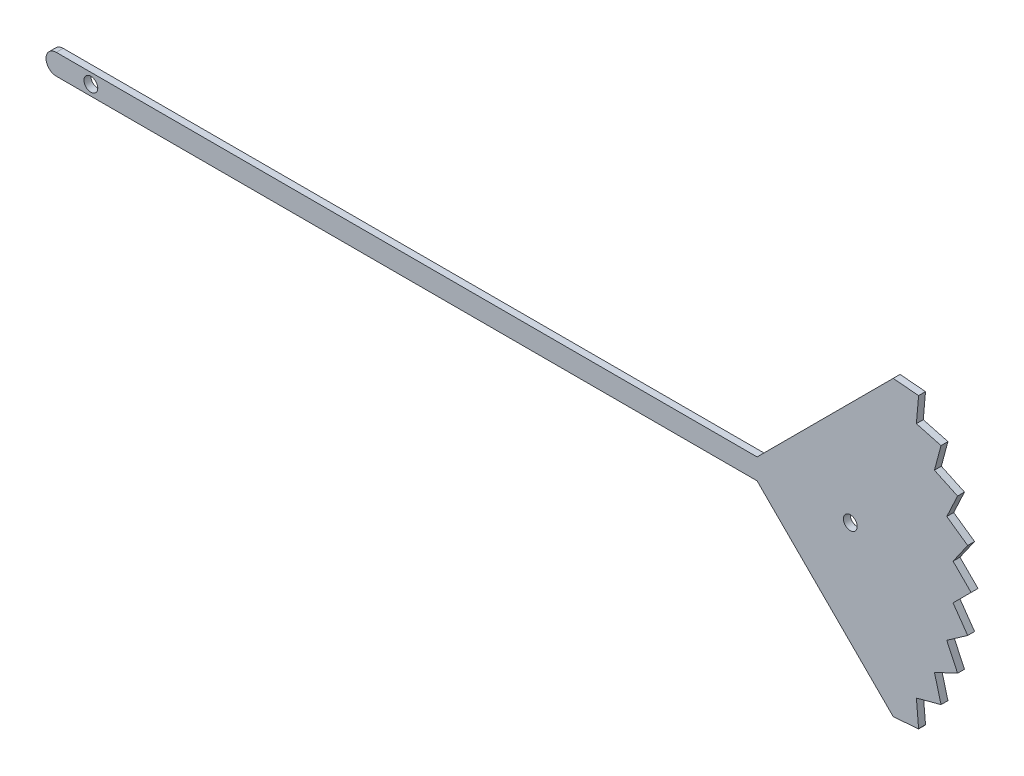
ISO-10303-21;
HEADER;
FILE_DESCRIPTION(('STEP AP214'),'2;1');
FILE_NAME('part.step','',(''),(''),'','','');
FILE_SCHEMA(('AUTOMOTIVE_DESIGN { 1 0 10303 214 1 1 1 1 }'));
ENDSEC;
DATA;
#1=APPLICATION_CONTEXT('core data for automotive mechanical design processes');
#2=APPLICATION_PROTOCOL_DEFINITION('international standard','automotive_design',2000,#1);
#3=PRODUCT_CONTEXT('',#1,'mechanical');
#4=PRODUCT('Part','Part','',(#3));
#5=PRODUCT_RELATED_PRODUCT_CATEGORY('part','',(#4));
#6=PRODUCT_DEFINITION_FORMATION('','',#4);
#7=PRODUCT_DEFINITION_CONTEXT('part definition',#1,'design');
#8=PRODUCT_DEFINITION('design','',#6,#7);
#9=PRODUCT_DEFINITION_SHAPE('','',#8);
#10=(LENGTH_UNIT() NAMED_UNIT(*) SI_UNIT(.MILLI.,.METRE.));
#11=(NAMED_UNIT(*) PLANE_ANGLE_UNIT() SI_UNIT($,.RADIAN.));
#12=(NAMED_UNIT(*) SI_UNIT($,.STERADIAN.) SOLID_ANGLE_UNIT());
#13=UNCERTAINTY_MEASURE_WITH_UNIT(LENGTH_MEASURE(1.E-05),#10,'distance_accuracy_value','');
#14=(GEOMETRIC_REPRESENTATION_CONTEXT(3) GLOBAL_UNCERTAINTY_ASSIGNED_CONTEXT((#13)) GLOBAL_UNIT_ASSIGNED_CONTEXT((#10,
#11,#12)) REPRESENTATION_CONTEXT('',''));
#15=CARTESIAN_POINT('',(0.,0.,0.));
#16=DIRECTION('',(0.,0.,1.));
#17=DIRECTION('',(1.,0.,0.));
#18=AXIS2_PLACEMENT_3D('',#15,#16,#17);
#19=CARTESIAN_POINT('',(67.9759144826428,3.,1.));
#20=DIRECTION('',(0.,1.,0.));
#21=DIRECTION('',(0.,0.,1.));
#22=AXIS2_PLACEMENT_3D('',#19,#20,#21);
#23=PLANE('',#22);
#24=DIRECTION('',(1.,0.,0.));
#25=VECTOR('',#24,1.);
#26=CARTESIAN_POINT('',(67.9759144826428,3.,-1.));
#27=LINE('',#26,#25);
#28=CARTESIAN_POINT('',(-62.7323713453704,3.,-1.));
#29=VERTEX_POINT('',#28);
#30=CARTESIAN_POINT('',(140.287932097177,3.,-1.));
#31=VERTEX_POINT('',#30);
#32=EDGE_CURVE('E230',#29,#31,#27,.T.);
#33=ORIENTED_EDGE('',*,*,#32,.F.);
#34=DIRECTION('',(0.,0.,-1.));
#35=VECTOR('',#34,1.);
#36=CARTESIAN_POINT('',(-62.7323713453704,3.,1.));
#37=LINE('',#36,#35);
#38=CARTESIAN_POINT('',(-62.7323713453704,3.,1.));
#39=VERTEX_POINT('',#38);
#40=EDGE_CURVE('E11',#39,#29,#37,.T.);
#41=ORIENTED_EDGE('',*,*,#40,.F.);
#42=DIRECTION('',(1.,0.,0.));
#43=VECTOR('',#42,1.);
#44=CARTESIAN_POINT('',(67.9759144826428,3.,1.));
#45=LINE('',#44,#43);
#46=CARTESIAN_POINT('',(140.287932097177,3.,1.));
#47=VERTEX_POINT('',#46);
#48=EDGE_CURVE('E708',#39,#47,#45,.T.);
#49=ORIENTED_EDGE('',*,*,#48,.T.);
#50=DIRECTION('',(0.,0.,-1.));
#51=VECTOR('',#50,1.);
#52=CARTESIAN_POINT('',(140.287932097177,3.,1.));
#53=LINE('',#52,#51);
#54=EDGE_CURVE('E50',#47,#31,#53,.T.);
#55=ORIENTED_EDGE('',*,*,#54,.T.);
#56=EDGE_LOOP('',(#33,#41,#49,#55));
#57=FACE_BOUND('',#56,.T.);
#58=ADVANCED_FACE('F33',(#57),#23,.T.);
#59=CARTESIAN_POINT('',(-62.7120679028232,0.,1.));
#60=DIRECTION('',(0.,0.,-1.));
#61=DIRECTION('',(-1.,0.,0.));
#62=AXIS2_PLACEMENT_3D('',#59,#60,#61);
#63=CYLINDRICAL_SURFACE('',#62,3.0000687041765);
#64=CARTESIAN_POINT('',(-62.7120679028232,0.,-1.));
#65=DIRECTION('',(0.,0.,1.));
#66=DIRECTION('',(1.,0.,0.));
#67=AXIS2_PLACEMENT_3D('',#64,#65,#66);
#68=CIRCLE('',#67,3.0000687041765);
#69=CARTESIAN_POINT('',(-62.7323713453704,-3.,-1.));
#70=VERTEX_POINT('',#69);
#71=EDGE_CURVE('E232',#29,#70,#68,.T.);
#72=ORIENTED_EDGE('',*,*,#71,.T.);
#73=DIRECTION('',(0.,0.,-1.));
#74=VECTOR('',#73,1.);
#75=CARTESIAN_POINT('',(-62.7323713453704,-3.,1.));
#76=LINE('',#75,#74);
#77=CARTESIAN_POINT('',(-62.7323713453704,-3.,1.));
#78=VERTEX_POINT('',#77);
#79=EDGE_CURVE('E42',#78,#70,#76,.T.);
#80=ORIENTED_EDGE('',*,*,#79,.F.);
#81=CARTESIAN_POINT('',(-62.7120679028232,0.,1.));
#82=DIRECTION('',(0.,0.,1.));
#83=DIRECTION('',(1.,0.,0.));
#84=AXIS2_PLACEMENT_3D('',#81,#82,#83);
#85=CIRCLE('',#84,3.0000687041765);
#86=EDGE_CURVE('E706',#39,#78,#85,.T.);
#87=ORIENTED_EDGE('',*,*,#86,.F.);
#88=ORIENTED_EDGE('',*,*,#40,.T.);
#89=EDGE_LOOP('',(#72,#80,#87,#88));
#90=FACE_BOUND('',#89,.T.);
#91=ADVANCED_FACE('F348',(#90),#63,.T.);
#92=CARTESIAN_POINT('',(67.9759144826428,-3.,1.));
#93=DIRECTION('',(0.,1.,0.));
#94=DIRECTION('',(0.,0.,1.));
#95=AXIS2_PLACEMENT_3D('',#92,#93,#94);
#96=PLANE('',#95);
#97=DIRECTION('',(1.,0.,0.));
#98=VECTOR('',#97,1.);
#99=CARTESIAN_POINT('',(67.9759144826428,-3.,-1.));
#100=LINE('',#99,#98);
#101=CARTESIAN_POINT('',(140.287932097177,-3.,-1.));
#102=VERTEX_POINT('',#101);
#103=EDGE_CURVE('E235',#70,#102,#100,.T.);
#104=ORIENTED_EDGE('',*,*,#103,.T.);
#105=DIRECTION('',(0.,0.,-1.));
#106=VECTOR('',#105,1.);
#107=CARTESIAN_POINT('',(140.287932097177,-3.,1.));
#108=LINE('',#107,#106);
#109=CARTESIAN_POINT('',(140.287932097177,-3.,1.));
#110=VERTEX_POINT('',#109);
#111=EDGE_CURVE('E336',#110,#102,#108,.T.);
#112=ORIENTED_EDGE('',*,*,#111,.F.);
#113=DIRECTION('',(1.,0.,0.));
#114=VECTOR('',#113,1.);
#115=CARTESIAN_POINT('',(67.9759144826428,-3.,1.));
#116=LINE('',#115,#114);
#117=EDGE_CURVE('E344',#78,#110,#116,.T.);
#118=ORIENTED_EDGE('',*,*,#117,.F.);
#119=ORIENTED_EDGE('',*,*,#79,.T.);
#120=EDGE_LOOP('',(#104,#112,#118,#119));
#121=FACE_BOUND('',#120,.T.);
#122=ADVANCED_FACE('F341',(#121),#96,.F.);
#123=CARTESIAN_POINT('',(205.577231788848,-68.2892996916711,1.));
#124=DIRECTION('',(0.707106781186547,0.707106781186547,0.));
#125=DIRECTION('',(-0.707106781186548,0.707106781186548,0.));
#126=AXIS2_PLACEMENT_3D('',#123,#124,#125);
#127=PLANE('',#126);
#128=DIRECTION('',(0.707106781186548,-0.707106781186548,0.));
#129=VECTOR('',#128,1.);
#130=CARTESIAN_POINT('',(205.577231788848,-68.2892996916711,-1.));
#131=LINE('',#130,#129);
#132=CARTESIAN_POINT('',(179.71433896837,-42.4264068711929,-1.));
#133=VERTEX_POINT('',#132);
#134=EDGE_CURVE('E238',#102,#133,#131,.T.);
#135=ORIENTED_EDGE('',*,*,#134,.T.);
#136=DIRECTION('',(0.,0.,-1.));
#137=VECTOR('',#136,1.);
#138=CARTESIAN_POINT('',(179.71433896837,-42.4264068711929,1.));
#139=LINE('',#138,#137);
#140=CARTESIAN_POINT('',(179.71433896837,-42.4264068711929,1.));
#141=VERTEX_POINT('',#140);
#142=EDGE_CURVE('E334',#141,#133,#139,.T.);
#143=ORIENTED_EDGE('',*,*,#142,.F.);
#144=DIRECTION('',(0.707106781186548,-0.707106781186548,0.));
#145=VECTOR('',#144,1.);
#146=CARTESIAN_POINT('',(205.577231788848,-68.2892996916711,1.));
#147=LINE('',#146,#145);
#148=EDGE_CURVE('E630',#110,#141,#147,.T.);
#149=ORIENTED_EDGE('',*,*,#148,.F.);
#150=ORIENTED_EDGE('',*,*,#111,.T.);
#151=EDGE_LOOP('',(#135,#143,#149,#150));
#152=FACE_BOUND('',#151,.T.);
#153=ADVANCED_FACE('F454',(#152),#127,.F.);
#154=CARTESIAN_POINT('',(56.5048975861414,-51.5857938224155,1.));
#155=DIRECTION('',(0.0741354063934308,-0.997248184515209,0.));
#156=DIRECTION('',(0.997248184515209,0.0741354063934308,0.));
#157=AXIS2_PLACEMENT_3D('',#154,#155,#156);
#158=PLANE('',#157);
#159=DIRECTION('',(-0.997248184515209,-0.0741354063934308,0.));
#160=VECTOR('',#159,1.);
#161=CARTESIAN_POINT('',(56.5048975861414,-51.5857938224155,-1.));
#162=LINE('',#161,#160);
#163=CARTESIAN_POINT('',(187.058698636574,-41.8804273475835,-1.));
#164=VERTEX_POINT('',#163);
#165=EDGE_CURVE('E241',#164,#133,#162,.T.);
#166=ORIENTED_EDGE('',*,*,#165,.F.);
#167=DIRECTION('',(0.,0.,-1.));
#168=VECTOR('',#167,1.);
#169=CARTESIAN_POINT('',(187.058698636574,-41.8804273475835,1.));
#170=LINE('',#169,#168);
#171=CARTESIAN_POINT('',(187.058698636574,-41.8804273475835,1.));
#172=VERTEX_POINT('',#171);
#173=EDGE_CURVE('E332',#172,#164,#170,.T.);
#174=ORIENTED_EDGE('',*,*,#173,.F.);
#175=DIRECTION('',(-0.997248184515209,-0.0741354063934308,0.));
#176=VECTOR('',#175,1.);
#177=CARTESIAN_POINT('',(56.5048975861414,-51.5857938224155,1.));
#178=LINE('',#177,#176);
#179=EDGE_CURVE('E626',#172,#141,#178,.T.);
#180=ORIENTED_EDGE('',*,*,#179,.T.);
#181=ORIENTED_EDGE('',*,*,#142,.T.);
#182=EDGE_LOOP('',(#166,#174,#180,#181));
#183=FACE_BOUND('',#182,.T.);
#184=ADVANCED_FACE('F450',(#183),#158,.T.);
#185=CARTESIAN_POINT('',(146.588411182905,-223.415949260086,1.));
#186=DIRECTION('',(0.976039892039487,-0.217591656888646,0.));
#187=DIRECTION('',(0.217591656888646,0.976039892039487,0.));
#188=AXIS2_PLACEMENT_3D('',#185,#186,#187);
#189=PLANE('',#188);
#190=DIRECTION('',(-0.217591656888646,-0.976039892039487,0.));
#191=VECTOR('',#190,1.);
#192=CARTESIAN_POINT('',(146.588411182905,-223.415949260086,-1.));
#193=LINE('',#192,#191);
#194=CARTESIAN_POINT('',(187.080820899911,-41.7811946296231,-1.));
#195=VERTEX_POINT('',#194);
#196=EDGE_CURVE('E244',#195,#164,#193,.T.);
#197=ORIENTED_EDGE('',*,*,#196,.F.);
#198=DIRECTION('',(0.,0.,-1.));
#199=VECTOR('',#198,1.);
#200=CARTESIAN_POINT('',(187.080820899911,-41.7811946296231,1.));
#201=LINE('',#200,#199);
#202=CARTESIAN_POINT('',(187.080820899911,-41.7811946296231,1.));
#203=VERTEX_POINT('',#202);
#204=EDGE_CURVE('E330',#203,#195,#201,.T.);
#205=ORIENTED_EDGE('',*,*,#204,.F.);
#206=DIRECTION('',(-0.217591656888646,-0.976039892039487,0.));
#207=VECTOR('',#206,1.);
#208=CARTESIAN_POINT('',(146.588411182905,-223.415949260086,1.));
#209=LINE('',#208,#207);
#210=EDGE_CURVE('E629',#203,#172,#209,.T.);
#211=ORIENTED_EDGE('',*,*,#210,.T.);
#212=ORIENTED_EDGE('',*,*,#173,.T.);
#213=EDGE_LOOP('',(#197,#205,#211,#212));
#214=FACE_BOUND('',#213,.T.);
#215=ADVANCED_FACE('F446',(#214),#189,.T.);
#216=CARTESIAN_POINT('',(200.41090190856,-194.317155212037,1.));
#217=DIRECTION('',(0.996203247885629,0.0870579628875118,0.));
#218=DIRECTION('',(-0.0870579628875118,0.99620324788563,0.));
#219=AXIS2_PLACEMENT_3D('',#216,#217,#218);
#220=PLANE('',#219);
#221=DIRECTION('',(0.0870579628875118,-0.99620324788563,0.));
#222=VECTOR('',#221,1.);
#223=CARTESIAN_POINT('',(200.41090190856,-194.317155212037,-1.));
#224=LINE('',#223,#222);
#225=CARTESIAN_POINT('',(186.437054754515,-34.4145861810592,-1.));
#226=VERTEX_POINT('',#225);
#227=EDGE_CURVE('E247',#226,#195,#224,.T.);
#228=ORIENTED_EDGE('',*,*,#227,.F.);
#229=DIRECTION('',(0.,0.,-1.));
#230=VECTOR('',#229,1.);
#231=CARTESIAN_POINT('',(186.437054754515,-34.4145861810592,1.));
#232=LINE('',#231,#230);
#233=CARTESIAN_POINT('',(186.437054754515,-34.4145861810592,1.));
#234=VERTEX_POINT('',#233);
#235=EDGE_CURVE('E328',#234,#226,#232,.T.);
#236=ORIENTED_EDGE('',*,*,#235,.F.);
#237=DIRECTION('',(0.0870579628875118,-0.99620324788563,0.));
#238=VECTOR('',#237,1.);
#239=CARTESIAN_POINT('',(200.41090190856,-194.317155212037,1.));
#240=LINE('',#239,#238);
#241=EDGE_CURVE('E632',#234,#203,#240,.T.);
#242=ORIENTED_EDGE('',*,*,#241,.T.);
#243=ORIENTED_EDGE('',*,*,#204,.T.);
#244=EDGE_LOOP('',(#228,#236,#242,#243));
#245=FACE_BOUND('',#244,.T.);
#246=ADVANCED_FACE('F442',(#245),#220,.T.);
#247=CARTESIAN_POINT('',(33.0335379981473,-75.5350730874777,1.));
#248=DIRECTION('',(0.258913852317546,-0.96590041778544,0.));
#249=DIRECTION('',(0.96590041778544,0.258913852317546,0.));
#250=AXIS2_PLACEMENT_3D('',#247,#248,#249);
#251=PLANE('',#250);
#252=DIRECTION('',(-0.96590041778544,-0.258913852317546,0.));
#253=VECTOR('',#252,1.);
#254=CARTESIAN_POINT('',(33.0335379981473,-75.5350730874777,-1.));
#255=LINE('',#254,#253);
#256=CARTESIAN_POINT('',(193.579583343163,-32.4999999999961,-1.));
#257=VERTEX_POINT('',#256);
#258=EDGE_CURVE('E250',#257,#226,#255,.T.);
#259=ORIENTED_EDGE('',*,*,#258,.F.);
#260=DIRECTION('',(0.,0.,-1.));
#261=VECTOR('',#260,1.);
#262=CARTESIAN_POINT('',(193.579583343163,-32.4999999999961,1.));
#263=LINE('',#262,#261);
#264=CARTESIAN_POINT('',(193.579583343163,-32.4999999999961,1.));
#265=VERTEX_POINT('',#264);
#266=EDGE_CURVE('E326',#265,#257,#263,.T.);
#267=ORIENTED_EDGE('',*,*,#266,.F.);
#268=DIRECTION('',(-0.96590041778544,-0.258913852317546,0.));
#269=VECTOR('',#268,1.);
#270=CARTESIAN_POINT('',(33.0335379981473,-75.5350730874777,1.));
#271=LINE('',#270,#269);
#272=EDGE_CURVE('E639',#265,#234,#271,.T.);
#273=ORIENTED_EDGE('',*,*,#272,.T.);
#274=ORIENTED_EDGE('',*,*,#235,.T.);
#275=EDGE_LOOP('',(#259,#267,#273,#274));
#276=FACE_BOUND('',#275,.T.);
#277=ADVANCED_FACE('F438',(#276),#251,.T.);
#278=CARTESIAN_POINT('',(228.50481077251,-162.893916071956,1.));
#279=DIRECTION('',(-0.965951225486896,-0.258724235394299,0.));
#280=DIRECTION('',(0.258724235394299,-0.965951225486896,0.));
#281=AXIS2_PLACEMENT_3D('',#278,#279,#280);
#282=PLANE('',#281);
#283=DIRECTION('',(-0.258724235394299,0.965951225486896,0.));
#284=VECTOR('',#283,1.);
#285=CARTESIAN_POINT('',(228.50481077251,-162.893916071956,-1.));
#286=LINE('',#285,#284);
#287=CARTESIAN_POINT('',(191.666399319372,-25.357095704437,-1.));
#288=VERTEX_POINT('',#287);
#289=EDGE_CURVE('E253',#257,#288,#286,.T.);
#290=ORIENTED_EDGE('',*,*,#289,.T.);
#291=DIRECTION('',(0.,0.,-1.));
#292=VECTOR('',#291,1.);
#293=CARTESIAN_POINT('',(191.666399319372,-25.357095704437,1.));
#294=LINE('',#293,#292);
#295=CARTESIAN_POINT('',(191.666399319372,-25.357095704437,1.));
#296=VERTEX_POINT('',#295);
#297=EDGE_CURVE('E324',#296,#288,#294,.T.);
#298=ORIENTED_EDGE('',*,*,#297,.F.);
#299=DIRECTION('',(-0.258724235394299,0.965951225486896,0.));
#300=VECTOR('',#299,1.);
#301=CARTESIAN_POINT('',(228.50481077251,-162.893916071956,1.));
#302=LINE('',#301,#300);
#303=EDGE_CURVE('E642',#265,#296,#302,.T.);
#304=ORIENTED_EDGE('',*,*,#303,.F.);
#305=ORIENTED_EDGE('',*,*,#266,.T.);
#306=EDGE_LOOP('',(#290,#298,#304,#305));
#307=FACE_BOUND('',#306,.T.);
#308=ADVANCED_FACE('F434',(#307),#282,.F.);
#309=CARTESIAN_POINT('',(20.917363160888,-104.999083579561,1.));
#310=DIRECTION('',(0.422707216480779,-0.90626630144515,0.));
#311=DIRECTION('',(0.90626630144515,0.422707216480779,0.));
#312=AXIS2_PLACEMENT_3D('',#309,#310,#311);
#313=PLANE('',#312);
#314=DIRECTION('',(-0.90626630144515,-0.422707216480779,0.));
#315=VECTOR('',#314,1.);
#316=CARTESIAN_POINT('',(20.917363160888,-104.999083579561,-1.));
#317=LINE('',#316,#315);
#318=CARTESIAN_POINT('',(198.367952448256,-22.231309316163,-1.));
#319=VERTEX_POINT('',#318);
#320=EDGE_CURVE('E256',#319,#288,#317,.T.);
#321=ORIENTED_EDGE('',*,*,#320,.F.);
#322=DIRECTION('',(0.,0.,-1.));
#323=VECTOR('',#322,1.);
#324=CARTESIAN_POINT('',(198.367952448256,-22.231309316163,1.));
#325=LINE('',#324,#323);
#326=CARTESIAN_POINT('',(198.367952448256,-22.231309316163,1.));
#327=VERTEX_POINT('',#326);
#328=EDGE_CURVE('E322',#327,#319,#325,.T.);
#329=ORIENTED_EDGE('',*,*,#328,.F.);
#330=DIRECTION('',(-0.90626630144515,-0.422707216480779,0.));
#331=VECTOR('',#330,1.);
#332=CARTESIAN_POINT('',(20.917363160888,-104.999083579561,1.));
#333=LINE('',#332,#331);
#334=EDGE_CURVE('E644',#327,#296,#333,.T.);
#335=ORIENTED_EDGE('',*,*,#334,.T.);
#336=ORIENTED_EDGE('',*,*,#297,.T.);
#337=EDGE_LOOP('',(#321,#329,#335,#336));
#338=FACE_BOUND('',#337,.T.);
#339=ADVANCED_FACE('F430',(#338),#313,.T.);
#340=CARTESIAN_POINT('',(245.422937317849,-123.166914500319,1.));
#341=DIRECTION('',(0.906349263896627,0.422529302929444,0.));
#342=DIRECTION('',(-0.422529302929444,0.906349263896627,0.));
#343=AXIS2_PLACEMENT_3D('',#340,#341,#342);
#344=PLANE('',#343);
#345=DIRECTION('',(0.422529302929444,-0.906349263896627,0.));
#346=VECTOR('',#345,1.);
#347=CARTESIAN_POINT('',(245.422937317849,-123.166914500319,-1.));
#348=LINE('',#347,#346);
#349=CARTESIAN_POINT('',(195.243481674514,-15.5291427061455,-1.));
#350=VERTEX_POINT('',#349);
#351=EDGE_CURVE('E259',#350,#319,#348,.T.);
#352=ORIENTED_EDGE('',*,*,#351,.F.);
#353=DIRECTION('',(0.,0.,-1.));
#354=VECTOR('',#353,1.);
#355=CARTESIAN_POINT('',(195.243481674514,-15.5291427061455,1.));
#356=LINE('',#355,#354);
#357=CARTESIAN_POINT('',(195.243481674514,-15.5291427061455,1.));
#358=VERTEX_POINT('',#357);
#359=EDGE_CURVE('E320',#358,#350,#356,.T.);
#360=ORIENTED_EDGE('',*,*,#359,.F.);
#361=DIRECTION('',(0.422529302929444,-0.906349263896627,0.));
#362=VECTOR('',#361,1.);
#363=CARTESIAN_POINT('',(245.422937317849,-123.166914500319,1.));
#364=LINE('',#363,#362);
#365=EDGE_CURVE('E647',#358,#327,#364,.T.);
#366=ORIENTED_EDGE('',*,*,#365,.T.);
#367=ORIENTED_EDGE('',*,*,#328,.T.);
#368=EDGE_LOOP('',(#352,#360,#366,#367));
#369=FACE_BOUND('',#368,.T.);
#370=ADVANCED_FACE('F426',(#369),#344,.T.);
#371=CARTESIAN_POINT('',(20.4103759551562,-137.974176975834,1.));
#372=DIRECTION('',(-0.573656835771419,0.819095742128308,0.));
#373=DIRECTION('',(-0.819095742128308,-0.573656835771419,0.));
#374=AXIS2_PLACEMENT_3D('',#371,#372,#373);
#375=PLANE('',#374);
#376=DIRECTION('',(0.819095742128308,0.573656835771419,0.));
#377=VECTOR('',#376,1.);
#378=CARTESIAN_POINT('',(20.4103759551562,-137.974176975834,-1.));
#379=LINE('',#378,#377);
#380=CARTESIAN_POINT('',(201.300436042962,-11.287131548344,-1.));
#381=VERTEX_POINT('',#380);
#382=EDGE_CURVE('E262',#350,#381,#379,.T.);
#383=ORIENTED_EDGE('',*,*,#382,.T.);
#384=DIRECTION('',(0.,0.,-1.));
#385=VECTOR('',#384,1.);
#386=CARTESIAN_POINT('',(201.300436042962,-11.287131548344,1.));
#387=LINE('',#386,#385);
#388=CARTESIAN_POINT('',(201.300436042962,-11.287131548344,1.));
#389=VERTEX_POINT('',#388);
#390=EDGE_CURVE('E318',#389,#381,#387,.T.);
#391=ORIENTED_EDGE('',*,*,#390,.F.);
#392=DIRECTION('',(0.819095742128308,0.573656835771419,0.));
#393=VECTOR('',#392,1.);
#394=CARTESIAN_POINT('',(20.4103759551562,-137.974176975834,1.));
#395=LINE('',#394,#393);
#396=EDGE_CURVE('E650',#358,#389,#395,.T.);
#397=ORIENTED_EDGE('',*,*,#396,.F.);
#398=ORIENTED_EDGE('',*,*,#359,.T.);
#399=EDGE_LOOP('',(#383,#391,#397,#398));
#400=FACE_BOUND('',#399,.T.);
#401=ADVANCED_FACE('F422',(#400),#375,.F.);
#402=CARTESIAN_POINT('',(248.877502782056,-79.2484210123428,1.));
#403=DIRECTION('',(0.819208338557716,0.573496031405193,0.));
#404=DIRECTION('',(-0.573496031405193,0.819208338557716,0.));
#405=AXIS2_PLACEMENT_3D('',#402,#403,#404);
#406=PLANE('',#405);
#407=DIRECTION('',(0.573496031405193,-0.819208338557716,0.));
#408=VECTOR('',#407,1.);
#409=CARTESIAN_POINT('',(248.877502782056,-79.2484210123428,-1.));
#410=LINE('',#409,#408);
#411=CARTESIAN_POINT('',(197.059613982671,-5.22934456485358,-1.));
#412=VERTEX_POINT('',#411);
#413=EDGE_CURVE('E265',#412,#381,#410,.T.);
#414=ORIENTED_EDGE('',*,*,#413,.F.);
#415=DIRECTION('',(0.,0.,-1.));
#416=VECTOR('',#415,1.);
#417=CARTESIAN_POINT('',(197.059613982671,-5.22934456485358,1.));
#418=LINE('',#417,#416);
#419=CARTESIAN_POINT('',(197.059613982671,-5.22934456485358,1.));
#420=VERTEX_POINT('',#419);
#421=EDGE_CURVE('E316',#420,#412,#418,.T.);
#422=ORIENTED_EDGE('',*,*,#421,.F.);
#423=DIRECTION('',(0.573496031405193,-0.819208338557716,0.));
#424=VECTOR('',#423,1.);
#425=CARTESIAN_POINT('',(248.877502782056,-79.2484210123428,1.));
#426=LINE('',#425,#424);
#427=EDGE_CURVE('E652',#420,#389,#426,.T.);
#428=ORIENTED_EDGE('',*,*,#427,.T.);
#429=ORIENTED_EDGE('',*,*,#390,.T.);
#430=EDGE_LOOP('',(#414,#422,#428,#429));
#431=FACE_BOUND('',#430,.T.);
#432=ADVANCED_FACE('F418',(#431),#406,.T.);
#433=CARTESIAN_POINT('',(32.1997998939296,-170.121524781622,1.));
#434=DIRECTION('',(0.707176182390224,-0.707037373170605,0.));
#435=DIRECTION('',(0.707037373170605,0.707176182390224,0.));
#436=AXIS2_PLACEMENT_3D('',#433,#434,#435);
#437=PLANE('',#436);
#438=DIRECTION('',(-0.707037373170605,-0.707176182390224,0.));
#439=VECTOR('',#438,1.);
#440=CARTESIAN_POINT('',(32.1997998939296,-170.121524781622,-1.));
#441=LINE('',#440,#439);
#442=CARTESIAN_POINT('',(202.287932097177,0.,-1.));
#443=VERTEX_POINT('',#442);
#444=EDGE_CURVE('E268',#443,#412,#441,.T.);
#445=ORIENTED_EDGE('',*,*,#444,.F.);
#446=DIRECTION('',(0.,0.,-1.));
#447=VECTOR('',#446,1.);
#448=CARTESIAN_POINT('',(202.287932097177,0.,1.));
#449=LINE('',#448,#447);
#450=CARTESIAN_POINT('',(202.287932097177,0.,1.));
#451=VERTEX_POINT('',#450);
#452=EDGE_CURVE('E314',#451,#443,#449,.T.);
#453=ORIENTED_EDGE('',*,*,#452,.F.);
#454=DIRECTION('',(-0.707037373170605,-0.707176182390224,0.));
#455=VECTOR('',#454,1.);
#456=CARTESIAN_POINT('',(32.1997998939296,-170.121524781622,1.));
#457=LINE('',#456,#455);
#458=EDGE_CURVE('E655',#451,#420,#457,.T.);
#459=ORIENTED_EDGE('',*,*,#458,.T.);
#460=ORIENTED_EDGE('',*,*,#421,.T.);
#461=EDGE_LOOP('',(#445,#453,#459,#460));
#462=FACE_BOUND('',#461,.T.);
#463=ADVANCED_FACE('F414',(#462),#437,.T.);
#464=CARTESIAN_POINT('',(238.090412924918,-35.8095097553379,1.));
#465=DIRECTION('',(0.707176182391343,0.707037373169485,0.));
#466=DIRECTION('',(-0.707037373169485,0.707176182391343,0.));
#467=AXIS2_PLACEMENT_3D('',#464,#465,#466);
#468=PLANE('',#467);
#469=DIRECTION('',(0.707037373169485,-0.707176182391343,0.));
#470=VECTOR('',#469,1.);
#471=CARTESIAN_POINT('',(238.090412924918,-35.8095097553379,-1.));
#472=LINE('',#471,#470);
#473=CARTESIAN_POINT('',(197.059613982682,5.22934456485977,-1.));
#474=VERTEX_POINT('',#473);
#475=EDGE_CURVE('E271',#474,#443,#472,.T.);
#476=ORIENTED_EDGE('',*,*,#475,.F.);
#477=DIRECTION('',(0.,0.,-1.));
#478=VECTOR('',#477,1.);
#479=CARTESIAN_POINT('',(197.059613982682,5.22934456485977,1.));
#480=LINE('',#479,#478);
#481=CARTESIAN_POINT('',(197.059613982682,5.22934456485977,1.));
#482=VERTEX_POINT('',#481);
#483=EDGE_CURVE('E312',#482,#474,#480,.T.);
#484=ORIENTED_EDGE('',*,*,#483,.F.);
#485=DIRECTION('',(0.707037373169485,-0.707176182391343,0.));
#486=VECTOR('',#485,1.);
#487=CARTESIAN_POINT('',(238.090412924918,-35.8095097553379,1.));
#488=LINE('',#487,#486);
#489=EDGE_CURVE('E658',#482,#451,#488,.T.);
#490=ORIENTED_EDGE('',*,*,#489,.T.);
#491=ORIENTED_EDGE('',*,*,#452,.T.);
#492=EDGE_LOOP('',(#476,#484,#490,#491));
#493=FACE_BOUND('',#492,.T.);
#494=ADVANCED_FACE('F410',(#493),#468,.T.);
#495=CARTESIAN_POINT('',(55.4174366405834,-197.098913027202,1.));
#496=DIRECTION('',(0.819208338557849,-0.573496031405003,0.));
#497=DIRECTION('',(0.573496031405003,0.819208338557849,0.));
#498=AXIS2_PLACEMENT_3D('',#495,#496,#497);
#499=PLANE('',#498);
#500=DIRECTION('',(-0.573496031405003,-0.819208338557849,0.));
#501=VECTOR('',#500,1.);
#502=CARTESIAN_POINT('',(55.4174366405834,-197.098913027202,-1.));
#503=LINE('',#502,#501);
#504=CARTESIAN_POINT('',(201.300436042971,11.2871315483506,-1.));
#505=VERTEX_POINT('',#504);
#506=EDGE_CURVE('E274',#505,#474,#503,.T.);
#507=ORIENTED_EDGE('',*,*,#506,.F.);
#508=DIRECTION('',(0.,0.,-1.));
#509=VECTOR('',#508,1.);
#510=CARTESIAN_POINT('',(201.300436042971,11.2871315483506,1.));
#511=LINE('',#510,#509);
#512=CARTESIAN_POINT('',(201.300436042971,11.2871315483506,1.));
#513=VERTEX_POINT('',#512);
#514=EDGE_CURVE('E310',#513,#505,#511,.T.);
#515=ORIENTED_EDGE('',*,*,#514,.F.);
#516=DIRECTION('',(-0.573496031405003,-0.819208338557849,0.));
#517=VECTOR('',#516,1.);
#518=CARTESIAN_POINT('',(55.4174366405834,-197.098913027202,1.));
#519=LINE('',#518,#517);
#520=EDGE_CURVE('E661',#513,#482,#519,.T.);
#521=ORIENTED_EDGE('',*,*,#520,.T.);
#522=ORIENTED_EDGE('',*,*,#483,.T.);
#523=EDGE_LOOP('',(#507,#515,#521,#522));
#524=FACE_BOUND('',#523,.T.);
#525=ADVANCED_FACE('F406',(#524),#499,.T.);
#526=CARTESIAN_POINT('',(213.898089321875,2.46431689259224,1.));
#527=DIRECTION('',(0.573656835771253,0.819095742128424,0.));
#528=DIRECTION('',(-0.819095742128424,0.573656835771253,0.));
#529=AXIS2_PLACEMENT_3D('',#526,#527,#528);
#530=PLANE('',#529);
#531=DIRECTION('',(0.819095742128424,-0.573656835771253,0.));
#532=VECTOR('',#531,1.);
#533=CARTESIAN_POINT('',(213.898089321875,2.46431689259224,-1.));
#534=LINE('',#533,#532);
#535=CARTESIAN_POINT('',(195.243481674521,15.5291427061512,-1.));
#536=VERTEX_POINT('',#535);
#537=EDGE_CURVE('E277',#536,#505,#534,.T.);
#538=ORIENTED_EDGE('',*,*,#537,.F.);
#539=DIRECTION('',(0.,0.,-1.));
#540=VECTOR('',#539,1.);
#541=CARTESIAN_POINT('',(195.243481674521,15.5291427061512,1.));
#542=LINE('',#541,#540);
#543=CARTESIAN_POINT('',(195.243481674521,15.5291427061512,1.));
#544=VERTEX_POINT('',#543);
#545=EDGE_CURVE('E308',#544,#536,#542,.T.);
#546=ORIENTED_EDGE('',*,*,#545,.F.);
#547=DIRECTION('',(0.819095742128424,-0.573656835771253,0.));
#548=VECTOR('',#547,1.);
#549=CARTESIAN_POINT('',(213.898089321875,2.46431689259224,1.));
#550=LINE('',#549,#548);
#551=EDGE_CURVE('E664',#544,#513,#550,.T.);
#552=ORIENTED_EDGE('',*,*,#551,.T.);
#553=ORIENTED_EDGE('',*,*,#514,.T.);
#554=EDGE_LOOP('',(#538,#546,#552,#553));
#555=FACE_BOUND('',#554,.T.);
#556=ADVANCED_FACE('F402',(#555),#530,.T.);
#557=CARTESIAN_POINT('',(87.7275572088137,-215.098599135926,1.));
#558=DIRECTION('',(0.906349263896736,-0.422529302929211,0.));
#559=DIRECTION('',(0.422529302929211,0.906349263896736,0.));
#560=AXIS2_PLACEMENT_3D('',#557,#558,#559);
#561=PLANE('',#560);
#562=DIRECTION('',(-0.422529302929211,-0.906349263896736,0.));
#563=VECTOR('',#562,1.);
#564=CARTESIAN_POINT('',(87.7275572088137,-215.098599135926,-1.));
#565=LINE('',#564,#563);
#566=CARTESIAN_POINT('',(198.367952448261,22.2313093161686,-1.));
#567=VERTEX_POINT('',#566);
#568=EDGE_CURVE('E280',#567,#536,#565,.T.);
#569=ORIENTED_EDGE('',*,*,#568,.F.);
#570=DIRECTION('',(0.,0.,-1.));
#571=VECTOR('',#570,1.);
#572=CARTESIAN_POINT('',(198.367952448261,22.2313093161686,1.));
#573=LINE('',#572,#571);
#574=CARTESIAN_POINT('',(198.367952448261,22.2313093161686,1.));
#575=VERTEX_POINT('',#574);
#576=EDGE_CURVE('E306',#575,#567,#573,.T.);
#577=ORIENTED_EDGE('',*,*,#576,.F.);
#578=DIRECTION('',(-0.422529302929211,-0.906349263896736,0.));
#579=VECTOR('',#578,1.);
#580=CARTESIAN_POINT('',(87.7275572088137,-215.098599135926,1.));
#581=LINE('',#580,#579);
#582=EDGE_CURVE('E667',#575,#544,#581,.T.);
#583=ORIENTED_EDGE('',*,*,#582,.T.);
#584=ORIENTED_EDGE('',*,*,#545,.T.);
#585=EDGE_LOOP('',(#569,#577,#583,#584));
#586=FACE_BOUND('',#585,.T.);
#587=ADVANCED_FACE('F398',(#586),#561,.T.);
#588=CARTESIAN_POINT('',(178.664703057035,31.4214399571388,1.));
#589=DIRECTION('',(-0.422707216480696,-0.906266301445189,0.));
#590=DIRECTION('',(0.906266301445189,-0.422707216480696,0.));
#591=AXIS2_PLACEMENT_3D('',#588,#589,#590);
#592=PLANE('',#591);
#593=DIRECTION('',(-0.906266301445189,0.422707216480696,0.));
#594=VECTOR('',#593,1.);
#595=CARTESIAN_POINT('',(178.664703057035,31.4214399571388,-1.));
#596=LINE('',#595,#594);
#597=CARTESIAN_POINT('',(191.666399319376,25.3570957044424,-1.));
#598=VERTEX_POINT('',#597);
#599=EDGE_CURVE('E283',#567,#598,#596,.T.);
#600=ORIENTED_EDGE('',*,*,#599,.T.);
#601=DIRECTION('',(0.,0.,-1.));
#602=VECTOR('',#601,1.);
#603=CARTESIAN_POINT('',(191.666399319376,25.3570957044424,1.));
#604=LINE('',#603,#602);
#605=CARTESIAN_POINT('',(191.666399319376,25.3570957044424,1.));
#606=VERTEX_POINT('',#605);
#607=EDGE_CURVE('E304',#606,#598,#604,.T.);
#608=ORIENTED_EDGE('',*,*,#607,.F.);
#609=DIRECTION('',(-0.906266301445189,0.422707216480696,0.));
#610=VECTOR('',#609,1.);
#611=CARTESIAN_POINT('',(178.664703057035,31.4214399571388,1.));
#612=LINE('',#611,#610);
#613=EDGE_CURVE('E670',#575,#606,#612,.T.);
#614=ORIENTED_EDGE('',*,*,#613,.F.);
#615=ORIENTED_EDGE('',*,*,#576,.T.);
#616=EDGE_LOOP('',(#600,#608,#614,#615));
#617=FACE_BOUND('',#616,.T.);
#618=ADVANCED_FACE('F394',(#617),#592,.F.);
#619=CARTESIAN_POINT('',(125.594506872986,-221.323410980993,1.));
#620=DIRECTION('',(0.965951225486935,-0.258724235394152,0.));
#621=DIRECTION('',(0.258724235394152,0.965951225486935,0.));
#622=AXIS2_PLACEMENT_3D('',#619,#620,#621);
#623=PLANE('',#622);
#624=DIRECTION('',(-0.258724235394152,-0.965951225486935,0.));
#625=VECTOR('',#624,1.);
#626=CARTESIAN_POINT('',(125.594506872986,-221.323410980993,-1.));
#627=LINE('',#626,#625);
#628=CARTESIAN_POINT('',(193.579583343165,32.5000000000002,-1.));
#629=VERTEX_POINT('',#628);
#630=EDGE_CURVE('E286',#629,#598,#627,.T.);
#631=ORIENTED_EDGE('',*,*,#630,.F.);
#632=DIRECTION('',(0.,0.,-1.));
#633=VECTOR('',#632,1.);
#634=CARTESIAN_POINT('',(193.579583343165,32.5000000000002,1.));
#635=LINE('',#634,#633);
#636=CARTESIAN_POINT('',(193.579583343165,32.5000000000002,1.));
#637=VERTEX_POINT('',#636);
#638=EDGE_CURVE('E302',#637,#629,#635,.T.);
#639=ORIENTED_EDGE('',*,*,#638,.F.);
#640=DIRECTION('',(-0.258724235394152,-0.965951225486935,0.));
#641=VECTOR('',#640,1.);
#642=CARTESIAN_POINT('',(125.594506872986,-221.323410980993,1.));
#643=LINE('',#642,#641);
#644=EDGE_CURVE('E672',#637,#606,#643,.T.);
#645=ORIENTED_EDGE('',*,*,#644,.T.);
#646=ORIENTED_EDGE('',*,*,#607,.T.);
#647=EDGE_LOOP('',(#631,#639,#645,#646));
#648=FACE_BOUND('',#647,.T.);
#649=ADVANCED_FACE('F390',(#648),#623,.T.);
#650=CARTESIAN_POINT('',(136.013847129432,47.9307486052863,1.));
#651=DIRECTION('',(-0.258913852317459,-0.965900417785464,0.));
#652=DIRECTION('',(0.965900417785464,-0.258913852317459,0.));
#653=AXIS2_PLACEMENT_3D('',#650,#651,#652);
#654=PLANE('',#653);
#655=DIRECTION('',(-0.965900417785464,0.258913852317459,0.));
#656=VECTOR('',#655,1.);
#657=CARTESIAN_POINT('',(136.013847129432,47.9307486052863,-1.));
#658=LINE('',#657,#656);
#659=CARTESIAN_POINT('',(186.437054754516,34.4145861810628,-1.));
#660=VERTEX_POINT('',#659);
#661=EDGE_CURVE('E289',#629,#660,#658,.T.);
#662=ORIENTED_EDGE('',*,*,#661,.T.);
#663=DIRECTION('',(0.,0.,-1.));
#664=VECTOR('',#663,1.);
#665=CARTESIAN_POINT('',(186.437054754516,34.4145861810628,1.));
#666=LINE('',#665,#664);
#667=CARTESIAN_POINT('',(186.437054754516,34.4145861810628,1.));
#668=VERTEX_POINT('',#667);
#669=EDGE_CURVE('E216',#668,#660,#666,.T.);
#670=ORIENTED_EDGE('',*,*,#669,.F.);
#671=DIRECTION('',(-0.965900417785464,0.258913852317459,0.));
#672=VECTOR('',#671,1.);
#673=CARTESIAN_POINT('',(136.013847129432,47.9307486052863,1.));
#674=LINE('',#673,#672);
#675=EDGE_CURVE('E205',#637,#668,#674,.T.);
#676=ORIENTED_EDGE('',*,*,#675,.F.);
#677=ORIENTED_EDGE('',*,*,#638,.T.);
#678=EDGE_LOOP('',(#662,#670,#676,#677));
#679=FACE_BOUND('',#678,.T.);
#680=ADVANCED_FACE('F387',(#679),#654,.F.);
#681=CARTESIAN_POINT('',(164.698175663187,-214.343152203022,1.));
#682=DIRECTION('',(-0.996203247885646,0.0870579628873222,0.));
#683=DIRECTION('',(-0.0870579628873222,-0.996203247885646,0.));
#684=AXIS2_PLACEMENT_3D('',#681,#682,#683);
#685=PLANE('',#684);
#686=DIRECTION('',(0.0870579628873222,0.996203247885646,0.));
#687=VECTOR('',#686,1.);
#688=CARTESIAN_POINT('',(164.698175663187,-214.343152203022,-1.));
#689=LINE('',#688,#687);
#690=CARTESIAN_POINT('',(187.08082089991,41.7811946296251,-1.));
#691=VERTEX_POINT('',#690);
#692=EDGE_CURVE('E213',#660,#691,#689,.T.);
#693=ORIENTED_EDGE('',*,*,#692,.T.);
#694=DIRECTION('',(0.,0.,-1.));
#695=VECTOR('',#694,1.);
#696=CARTESIAN_POINT('',(187.08082089991,41.7811946296251,1.));
#697=LINE('',#696,#695);
#698=CARTESIAN_POINT('',(187.08082089991,41.7811946296251,1.));
#699=VERTEX_POINT('',#698);
#700=EDGE_CURVE('E211',#699,#691,#697,.T.);
#701=ORIENTED_EDGE('',*,*,#700,.F.);
#702=DIRECTION('',(0.0870579628873222,0.996203247885646,0.));
#703=VECTOR('',#702,1.);
#704=CARTESIAN_POINT('',(164.698175663187,-214.343152203022,1.));
#705=LINE('',#704,#703);
#706=EDGE_CURVE('E196',#668,#699,#705,.T.);
#707=ORIENTED_EDGE('',*,*,#706,.F.);
#708=ORIENTED_EDGE('',*,*,#669,.T.);
#709=EDGE_LOOP('',(#693,#701,#707,#708));
#710=FACE_BOUND('',#709,.T.);
#711=ADVANCED_FACE('F212',(#710),#685,.F.);
#712=CARTESIAN_POINT('',(90.4105005816247,50.2483129427207,1.));
#713=DIRECTION('',(0.0872535217683309,0.996186138700506,0.));
#714=DIRECTION('',(-0.996186138700506,0.0872535217683309,0.));
#715=AXIS2_PLACEMENT_3D('',#712,#713,#714);
#716=PLANE('',#715);
#717=DIRECTION('',(0.996186138700506,-0.0872535217683308,0.));
#718=VECTOR('',#717,1.);
#719=CARTESIAN_POINT('',(90.4105005816247,50.2483129427207,-1.));
#720=LINE('',#719,#718);
#721=CARTESIAN_POINT('',(179.71433896837,42.4264068711929,-1.));
#722=VERTEX_POINT('',#721);
#723=EDGE_CURVE('E293',#722,#691,#720,.T.);
#724=ORIENTED_EDGE('',*,*,#723,.F.);
#725=DIRECTION('',(0.,0.,-1.));
#726=VECTOR('',#725,1.);
#727=CARTESIAN_POINT('',(179.71433896837,42.4264068711929,1.));
#728=LINE('',#727,#726);
#729=CARTESIAN_POINT('',(179.71433896837,42.4264068711929,1.));
#730=VERTEX_POINT('',#729);
#731=EDGE_CURVE('E123',#730,#722,#728,.T.);
#732=ORIENTED_EDGE('',*,*,#731,.F.);
#733=DIRECTION('',(0.996186138700506,-0.0872535217683308,0.));
#734=VECTOR('',#733,1.);
#735=CARTESIAN_POINT('',(90.4105005816247,50.2483129427207,1.));
#736=LINE('',#735,#734);
#737=EDGE_CURVE('E202',#730,#699,#736,.T.);
#738=ORIENTED_EDGE('',*,*,#737,.T.);
#739=ORIENTED_EDGE('',*,*,#700,.T.);
#740=EDGE_LOOP('',(#724,#732,#738,#739));
#741=FACE_BOUND('',#740,.T.);
#742=ADVANCED_FACE('F218',(#741),#716,.T.);
#743=CARTESIAN_POINT('',(-52.7120679028232,0.,1.));
#744=DIRECTION('',(0.,0.,-1.));
#745=DIRECTION('',(-1.,0.,0.));
#746=AXIS2_PLACEMENT_3D('',#743,#744,#745);
#747=CYLINDRICAL_SURFACE('',#746,2.);
#748=CARTESIAN_POINT('',(-52.7120679028232,0.,1.));
#749=DIRECTION('',(0.,0.,1.));
#750=DIRECTION('',(1.,0.,0.));
#751=AXIS2_PLACEMENT_3D('',#748,#749,#750);
#752=CIRCLE('',#751,2.);
#753=CARTESIAN_POINT('',(-50.7120679028232,0.,1.));
#754=VERTEX_POINT('',#753);
#755=EDGE_CURVE('E371',#754,#754,#752,.T.);
#756=ORIENTED_EDGE('',*,*,#755,.T.);
#757=EDGE_LOOP('',(#756));
#758=FACE_BOUND('',#757,.T.);
#759=CARTESIAN_POINT('',(-52.7120679028232,0.,-1.));
#760=DIRECTION('',(0.,0.,1.));
#761=DIRECTION('',(1.,0.,0.));
#762=AXIS2_PLACEMENT_3D('',#759,#760,#761);
#763=CIRCLE('',#762,2.);
#764=CARTESIAN_POINT('',(-50.7120679028232,0.,-1.));
#765=VERTEX_POINT('',#764);
#766=EDGE_CURVE('E227',#765,#765,#763,.T.);
#767=ORIENTED_EDGE('',*,*,#766,.F.);
#768=EDGE_LOOP('',(#767));
#769=FACE_BOUND('',#768,.T.);
#770=ADVANCED_FACE('F358',(#758,#769),#747,.F.);
#771=CARTESIAN_POINT('',(167.287932097177,0.,1.));
#772=DIRECTION('',(0.,0.,-1.));
#773=DIRECTION('',(-1.,0.,0.));
#774=AXIS2_PLACEMENT_3D('',#771,#772,#773);
#775=CYLINDRICAL_SURFACE('',#774,2.);
#776=CARTESIAN_POINT('',(167.287932097177,0.,1.));
#777=DIRECTION('',(0.,0.,1.));
#778=DIRECTION('',(1.,0.,0.));
#779=AXIS2_PLACEMENT_3D('',#776,#777,#778);
#780=CIRCLE('',#779,2.);
#781=CARTESIAN_POINT('',(169.287932097177,0.,1.));
#782=VERTEX_POINT('',#781);
#783=EDGE_CURVE('E298',#782,#782,#780,.T.);
#784=ORIENTED_EDGE('',*,*,#783,.T.);
#785=EDGE_LOOP('',(#784));
#786=FACE_BOUND('',#785,.T.);
#787=CARTESIAN_POINT('',(167.287932097177,0.,-1.));
#788=DIRECTION('',(0.,0.,1.));
#789=DIRECTION('',(1.,0.,0.));
#790=AXIS2_PLACEMENT_3D('',#787,#788,#789);
#791=CIRCLE('',#790,2.);
#792=CARTESIAN_POINT('',(169.287932097177,0.,-1.));
#793=VERTEX_POINT('',#792);
#794=EDGE_CURVE('E224',#793,#793,#791,.T.);
#795=ORIENTED_EDGE('',*,*,#794,.F.);
#796=EDGE_LOOP('',(#795));
#797=FACE_BOUND('',#796,.T.);
#798=ADVANCED_FACE('F35',(#786,#797),#775,.F.);
#799=CARTESIAN_POINT('',(-0.313385209028225,-137.601317306206,1.));
#800=DIRECTION('',(-0.707106781186549,0.707106781186546,0.));
#801=DIRECTION('',(-0.707106781186546,-0.707106781186549,0.));
#802=AXIS2_PLACEMENT_3D('',#799,#800,#801);
#803=PLANE('',#802);
#804=DIRECTION('',(0.707106781186546,0.707106781186549,0.));
#805=VECTOR('',#804,1.);
#806=CARTESIAN_POINT('',(-0.313385209028225,-137.601317306206,-1.));
#807=LINE('',#806,#805);
#808=EDGE_CURVE('E295',#31,#722,#807,.T.);
#809=ORIENTED_EDGE('',*,*,#808,.F.);
#810=ORIENTED_EDGE('',*,*,#54,.F.);
#811=DIRECTION('',(0.707106781186546,0.707106781186549,0.));
#812=VECTOR('',#811,1.);
#813=CARTESIAN_POINT('',(-0.313385209028225,-137.601317306206,1.));
#814=LINE('',#813,#812);
#815=EDGE_CURVE('E219',#47,#730,#814,.T.);
#816=ORIENTED_EDGE('',*,*,#815,.T.);
#817=ORIENTED_EDGE('',*,*,#731,.T.);
#818=EDGE_LOOP('',(#809,#810,#816,#817));
#819=FACE_BOUND('',#818,.T.);
#820=ADVANCED_FACE('F365',(#819),#803,.T.);
#821=CARTESIAN_POINT('',(67.9759144826428,-205.890616997876,1.));
#822=DIRECTION('',(0.,0.,1.));
#823=DIRECTION('',(1.,0.,0.));
#824=AXIS2_PLACEMENT_3D('',#821,#822,#823);
#825=PLANE('',#824);
#826=ORIENTED_EDGE('',*,*,#783,.F.);
#827=EDGE_LOOP('',(#826));
#828=FACE_BOUND('',#827,.T.);
#829=ORIENTED_EDGE('',*,*,#755,.F.);
#830=EDGE_LOOP('',(#829));
#831=FACE_BOUND('',#830,.T.);
#832=ORIENTED_EDGE('',*,*,#48,.F.);
#833=ORIENTED_EDGE('',*,*,#86,.T.);
#834=ORIENTED_EDGE('',*,*,#117,.T.);
#835=ORIENTED_EDGE('',*,*,#148,.T.);
#836=ORIENTED_EDGE('',*,*,#179,.F.);
#837=ORIENTED_EDGE('',*,*,#210,.F.);
#838=ORIENTED_EDGE('',*,*,#241,.F.);
#839=ORIENTED_EDGE('',*,*,#272,.F.);
#840=ORIENTED_EDGE('',*,*,#303,.T.);
#841=ORIENTED_EDGE('',*,*,#334,.F.);
#842=ORIENTED_EDGE('',*,*,#365,.F.);
#843=ORIENTED_EDGE('',*,*,#396,.T.);
#844=ORIENTED_EDGE('',*,*,#427,.F.);
#845=ORIENTED_EDGE('',*,*,#458,.F.);
#846=ORIENTED_EDGE('',*,*,#489,.F.);
#847=ORIENTED_EDGE('',*,*,#520,.F.);
#848=ORIENTED_EDGE('',*,*,#551,.F.);
#849=ORIENTED_EDGE('',*,*,#582,.F.);
#850=ORIENTED_EDGE('',*,*,#613,.T.);
#851=ORIENTED_EDGE('',*,*,#644,.F.);
#852=ORIENTED_EDGE('',*,*,#675,.T.);
#853=ORIENTED_EDGE('',*,*,#706,.T.);
#854=ORIENTED_EDGE('',*,*,#737,.F.);
#855=ORIENTED_EDGE('',*,*,#815,.F.);
#856=EDGE_LOOP('',(#832,#833,#834,#835,#836,#837,#838,#839,#840,#841,#842,#843,#844,#845,#846,
#847,#848,#849,#850,#851,#852,#853,#854,#855));
#857=FACE_BOUND('',#856,.T.);
#858=ADVANCED_FACE('F199',(#828,#831,#857),#825,.T.);
#859=CARTESIAN_POINT('',(67.9759144826428,-205.890616997876,-1.));
#860=DIRECTION('',(0.,0.,1.));
#861=DIRECTION('',(1.,0.,0.));
#862=AXIS2_PLACEMENT_3D('',#859,#860,#861);
#863=PLANE('',#862);
#864=ORIENTED_EDGE('',*,*,#794,.T.);
#865=EDGE_LOOP('',(#864));
#866=FACE_BOUND('',#865,.T.);
#867=ORIENTED_EDGE('',*,*,#766,.T.);
#868=EDGE_LOOP('',(#867));
#869=FACE_BOUND('',#868,.T.);
#870=ORIENTED_EDGE('',*,*,#32,.T.);
#871=ORIENTED_EDGE('',*,*,#808,.T.);
#872=ORIENTED_EDGE('',*,*,#723,.T.);
#873=ORIENTED_EDGE('',*,*,#692,.F.);
#874=ORIENTED_EDGE('',*,*,#661,.F.);
#875=ORIENTED_EDGE('',*,*,#630,.T.);
#876=ORIENTED_EDGE('',*,*,#599,.F.);
#877=ORIENTED_EDGE('',*,*,#568,.T.);
#878=ORIENTED_EDGE('',*,*,#537,.T.);
#879=ORIENTED_EDGE('',*,*,#506,.T.);
#880=ORIENTED_EDGE('',*,*,#475,.T.);
#881=ORIENTED_EDGE('',*,*,#444,.T.);
#882=ORIENTED_EDGE('',*,*,#413,.T.);
#883=ORIENTED_EDGE('',*,*,#382,.F.);
#884=ORIENTED_EDGE('',*,*,#351,.T.);
#885=ORIENTED_EDGE('',*,*,#320,.T.);
#886=ORIENTED_EDGE('',*,*,#289,.F.);
#887=ORIENTED_EDGE('',*,*,#258,.T.);
#888=ORIENTED_EDGE('',*,*,#227,.T.);
#889=ORIENTED_EDGE('',*,*,#196,.T.);
#890=ORIENTED_EDGE('',*,*,#165,.T.);
#891=ORIENTED_EDGE('',*,*,#134,.F.);
#892=ORIENTED_EDGE('',*,*,#103,.F.);
#893=ORIENTED_EDGE('',*,*,#71,.F.);
#894=EDGE_LOOP('',(#870,#871,#872,#873,#874,#875,#876,#877,#878,#879,#880,#881,#882,#883,#884,
#885,#886,#887,#888,#889,#890,#891,#892,#893));
#895=FACE_BOUND('',#894,.T.);
#896=ADVANCED_FACE('F350',(#866,#869,#895),#863,.F.);
#897=CLOSED_SHELL('',(#58,#91,#122,#153,#184,#215,#246,#277,#308,#339,#370,#401,#432,#463,#494,
#525,#556,#587,#618,#649,#680,#711,#742,#770,#798,#820,#858,#896));
#898=MANIFOLD_SOLID_BREP('B2',#897);
#899=ADVANCED_BREP_SHAPE_REPRESENTATION('',(#18,#898),#14);
#900=SHAPE_DEFINITION_REPRESENTATION(#9,#899);
ENDSEC;
END-ISO-10303-21;
